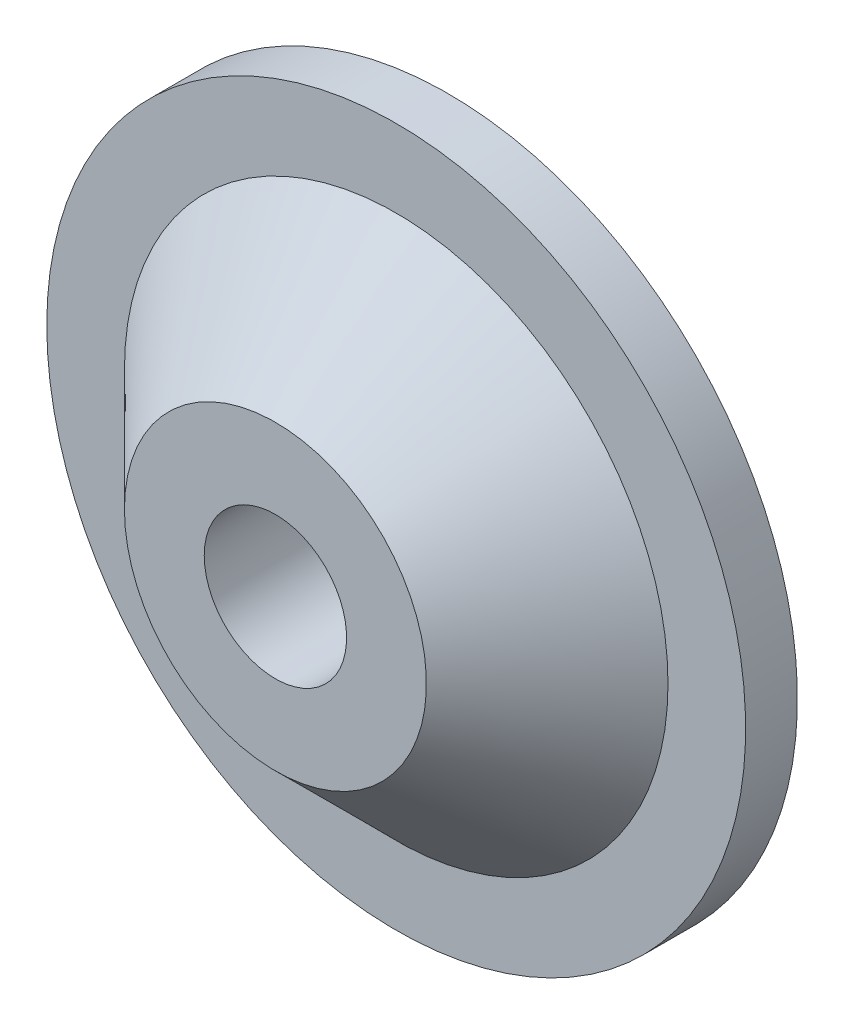
ISO-10303-21;
HEADER;
FILE_DESCRIPTION(('STEP AP214'),'2;1');
FILE_NAME('part.step','',(''),(''),'','','');
FILE_SCHEMA(('AUTOMOTIVE_DESIGN { 1 0 10303 214 1 1 1 1 }'));
ENDSEC;
DATA;
#1=APPLICATION_CONTEXT('core data for automotive mechanical design processes');
#2=APPLICATION_PROTOCOL_DEFINITION('international standard','automotive_design',2000,#1);
#3=PRODUCT_CONTEXT('',#1,'mechanical');
#4=PRODUCT('Part','Part','',(#3));
#5=PRODUCT_RELATED_PRODUCT_CATEGORY('part','',(#4));
#6=PRODUCT_DEFINITION_FORMATION('','',#4);
#7=PRODUCT_DEFINITION_CONTEXT('part definition',#1,'design');
#8=PRODUCT_DEFINITION('design','',#6,#7);
#9=PRODUCT_DEFINITION_SHAPE('','',#8);
#10=(LENGTH_UNIT() NAMED_UNIT(*) SI_UNIT(.MILLI.,.METRE.));
#11=(NAMED_UNIT(*) PLANE_ANGLE_UNIT() SI_UNIT($,.RADIAN.));
#12=(NAMED_UNIT(*) SI_UNIT($,.STERADIAN.) SOLID_ANGLE_UNIT());
#13=UNCERTAINTY_MEASURE_WITH_UNIT(LENGTH_MEASURE(1.E-05),#10,'distance_accuracy_value','');
#14=(GEOMETRIC_REPRESENTATION_CONTEXT(3) GLOBAL_UNCERTAINTY_ASSIGNED_CONTEXT((#13)) GLOBAL_UNIT_ASSIGNED_CONTEXT((#10,
#11,#12)) REPRESENTATION_CONTEXT('',''));
#15=CARTESIAN_POINT('',(0.,0.,0.));
#16=DIRECTION('',(0.,0.,1.));
#17=DIRECTION('',(1.,0.,0.));
#18=AXIS2_PLACEMENT_3D('',#15,#16,#17);
#19=CARTESIAN_POINT('',(0.,0.,2.8));
#20=DIRECTION('',(0.,0.,-1.));
#21=DIRECTION('',(-1.,0.,0.));
#22=AXIS2_PLACEMENT_3D('',#19,#20,#21);
#23=PLANE('',#22);
#24=CARTESIAN_POINT('',(0.,0.,2.8));
#25=DIRECTION('',(0.,0.,-1.));
#26=DIRECTION('',(-1.,0.,0.));
#27=AXIS2_PLACEMENT_3D('',#24,#25,#26);
#28=CIRCLE('',#27,3.5);
#29=CARTESIAN_POINT('',(-3.5,0.,2.8));
#30=VERTEX_POINT('',#29);
#31=EDGE_CURVE('E44',#30,#30,#28,.T.);
#32=ORIENTED_EDGE('',*,*,#31,.F.);
#33=EDGE_LOOP('',(#32));
#34=FACE_BOUND('',#33,.T.);
#35=CARTESIAN_POINT('',(0.,0.,2.8));
#36=DIRECTION('',(0.,0.,-1.));
#37=DIRECTION('',(-1.,0.,0.));
#38=AXIS2_PLACEMENT_3D('',#35,#36,#37);
#39=CIRCLE('',#38,1.65000000000001);
#40=CARTESIAN_POINT('',(-1.65000000000001,0.,2.8));
#41=VERTEX_POINT('',#40);
#42=EDGE_CURVE('E59',#41,#41,#39,.T.);
#43=ORIENTED_EDGE('',*,*,#42,.T.);
#44=EDGE_LOOP('',(#43));
#45=FACE_BOUND('',#44,.T.);
#46=ADVANCED_FACE('F33',(#34,#45),#23,.F.);
#47=CARTESIAN_POINT('',(0.,0.,2.8));
#48=DIRECTION('',(0.,0.,-1.));
#49=DIRECTION('',(-1.,0.,0.));
#50=AXIS2_PLACEMENT_3D('',#47,#48,#49);
#51=CONICAL_SURFACE('',#50,3.5,0.785398163397446);
#52=CARTESIAN_POINT('',(0.,0.,0.));
#53=DIRECTION('',(0.,0.,-1.));
#54=DIRECTION('',(-1.,0.,0.));
#55=AXIS2_PLACEMENT_3D('',#52,#53,#54);
#56=CIRCLE('',#55,6.29999999999998);
#57=CARTESIAN_POINT('',(-6.29999999999998,0.,0.));
#58=VERTEX_POINT('',#57);
#59=EDGE_CURVE('E48',#58,#58,#56,.T.);
#60=ORIENTED_EDGE('',*,*,#59,.F.);
#61=EDGE_LOOP('',(#60));
#62=FACE_BOUND('',#61,.T.);
#63=ORIENTED_EDGE('',*,*,#31,.T.);
#64=EDGE_LOOP('',(#63));
#65=FACE_BOUND('',#64,.T.);
#66=ADVANCED_FACE('F77',(#62,#65),#51,.T.);
#67=CARTESIAN_POINT('',(0.,0.,0.));
#68=DIRECTION('',(0.,0.,-1.));
#69=DIRECTION('',(-1.,0.,0.));
#70=AXIS2_PLACEMENT_3D('',#67,#68,#69);
#71=PLANE('',#70);
#72=CARTESIAN_POINT('',(0.,0.,0.));
#73=DIRECTION('',(0.,0.,-1.));
#74=DIRECTION('',(-1.,0.,0.));
#75=AXIS2_PLACEMENT_3D('',#72,#73,#74);
#76=CIRCLE('',#75,8.1);
#77=CARTESIAN_POINT('',(-8.1,0.,0.));
#78=VERTEX_POINT('',#77);
#79=EDGE_CURVE('E53',#78,#78,#76,.T.);
#80=ORIENTED_EDGE('',*,*,#79,.F.);
#81=EDGE_LOOP('',(#80));
#82=FACE_BOUND('',#81,.T.);
#83=ORIENTED_EDGE('',*,*,#59,.T.);
#84=EDGE_LOOP('',(#83));
#85=FACE_BOUND('',#84,.T.);
#86=ADVANCED_FACE('F82',(#82,#85),#71,.F.);
#87=CARTESIAN_POINT('',(0.,0.,-35.5800768174737));
#88=DIRECTION('',(0.,0.,-1.));
#89=DIRECTION('',(-1.,0.,0.));
#90=AXIS2_PLACEMENT_3D('',#87,#88,#89);
#91=CYLINDRICAL_SURFACE('',#90,8.1);
#92=CARTESIAN_POINT('',(0.,0.,-1.2));
#93=DIRECTION('',(0.,0.,-1.));
#94=DIRECTION('',(-1.,0.,0.));
#95=AXIS2_PLACEMENT_3D('',#92,#93,#94);
#96=CIRCLE('',#95,8.1);
#97=CARTESIAN_POINT('',(-8.1,0.,-1.2));
#98=VERTEX_POINT('',#97);
#99=EDGE_CURVE('E56',#98,#98,#96,.T.);
#100=ORIENTED_EDGE('',*,*,#99,.F.);
#101=EDGE_LOOP('',(#100));
#102=FACE_BOUND('',#101,.T.);
#103=ORIENTED_EDGE('',*,*,#79,.T.);
#104=EDGE_LOOP('',(#103));
#105=FACE_BOUND('',#104,.T.);
#106=ADVANCED_FACE('F74',(#102,#105),#91,.T.);
#107=CARTESIAN_POINT('',(0.,0.,-1.2));
#108=DIRECTION('',(0.,0.,1.));
#109=DIRECTION('',(1.,0.,0.));
#110=AXIS2_PLACEMENT_3D('',#107,#108,#109);
#111=PLANE('',#110);
#112=CARTESIAN_POINT('',(0.,0.,-1.2));
#113=DIRECTION('',(0.,0.,1.));
#114=DIRECTION('',(1.,0.,0.));
#115=AXIS2_PLACEMENT_3D('',#112,#113,#114);
#116=CIRCLE('',#115,2.15000000000001);
#117=CARTESIAN_POINT('',(2.15000000000001,0.,-1.2));
#118=VERTEX_POINT('',#117);
#119=EDGE_CURVE('E10',#118,#118,#116,.T.);
#120=ORIENTED_EDGE('',*,*,#119,.T.);
#121=EDGE_LOOP('',(#120));
#122=FACE_BOUND('',#121,.T.);
#123=ORIENTED_EDGE('',*,*,#99,.T.);
#124=EDGE_LOOP('',(#123));
#125=FACE_BOUND('',#124,.T.);
#126=ADVANCED_FACE('F66',(#122,#125),#111,.F.);
#127=CARTESIAN_POINT('',(0.,0.,-35.5800768174737));
#128=DIRECTION('',(0.,0.,-1.));
#129=DIRECTION('',(-1.,0.,0.));
#130=AXIS2_PLACEMENT_3D('',#127,#128,#129);
#131=CYLINDRICAL_SURFACE('',#130,1.65);
#132=CARTESIAN_POINT('',(0.,0.,-0.699999999999992));
#133=DIRECTION('',(0.,0.,1.));
#134=DIRECTION('',(1.,0.,0.));
#135=AXIS2_PLACEMENT_3D('',#132,#133,#134);
#136=CIRCLE('',#135,1.65);
#137=CARTESIAN_POINT('',(1.65,0.,-0.699999999999992));
#138=VERTEX_POINT('',#137);
#139=EDGE_CURVE('E40',#138,#138,#136,.F.);
#140=ORIENTED_EDGE('',*,*,#139,.T.);
#141=EDGE_LOOP('',(#140));
#142=FACE_BOUND('',#141,.T.);
#143=ORIENTED_EDGE('',*,*,#42,.F.);
#144=EDGE_LOOP('',(#143));
#145=FACE_BOUND('',#144,.T.);
#146=ADVANCED_FACE('F64',(#142,#145),#131,.F.);
#147=CARTESIAN_POINT('',(0.,0.,-0.699999999999992));
#148=DIRECTION('',(0.,0.,-1.));
#149=DIRECTION('',(-1.,0.,0.));
#150=AXIS2_PLACEMENT_3D('',#147,#148,#149);
#151=CONICAL_SURFACE('',#150,1.65,0.785398163397442);
#152=ORIENTED_EDGE('',*,*,#119,.F.);
#153=EDGE_LOOP('',(#152));
#154=FACE_BOUND('',#153,.T.);
#155=ORIENTED_EDGE('',*,*,#139,.F.);
#156=EDGE_LOOP('',(#155));
#157=FACE_BOUND('',#156,.T.);
#158=ADVANCED_FACE('F35',(#154,#157),#151,.F.);
#159=CLOSED_SHELL('',(#46,#66,#86,#106,#126,#146,#158));
#160=MANIFOLD_SOLID_BREP('B2',#159);
#161=ADVANCED_BREP_SHAPE_REPRESENTATION('',(#18,#160),#14);
#162=SHAPE_DEFINITION_REPRESENTATION(#9,#161);
ENDSEC;
END-ISO-10303-21;
